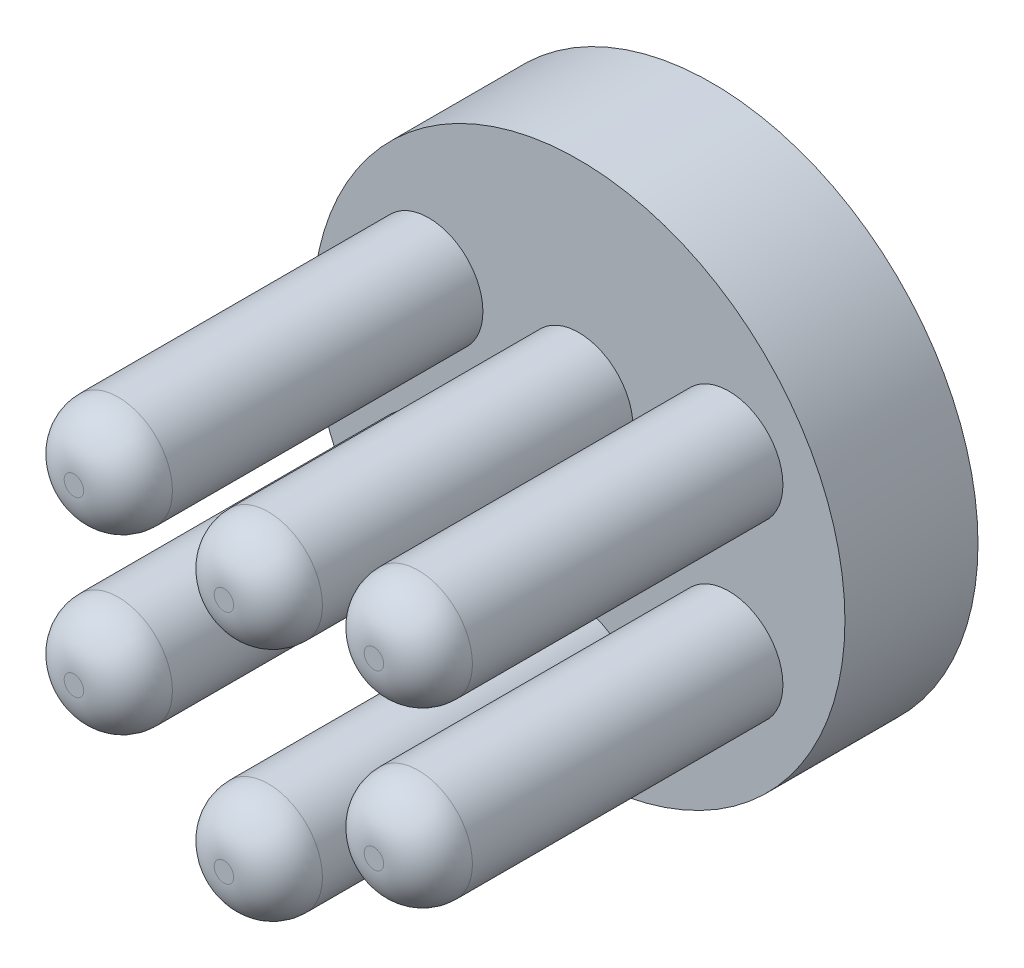
ISO-10303-21;
HEADER;
FILE_DESCRIPTION(('STEP AP214'),'2;1');
FILE_NAME('part.step','',(''),(''),'','','');
FILE_SCHEMA(('AUTOMOTIVE_DESIGN { 1 0 10303 214 1 1 1 1 }'));
ENDSEC;
DATA;
#1=APPLICATION_CONTEXT('core data for automotive mechanical design processes');
#2=APPLICATION_PROTOCOL_DEFINITION('international standard','automotive_design',2000,#1);
#3=PRODUCT_CONTEXT('',#1,'mechanical');
#4=PRODUCT('Part','Part','',(#3));
#5=PRODUCT_RELATED_PRODUCT_CATEGORY('part','',(#4));
#6=PRODUCT_DEFINITION_FORMATION('','',#4);
#7=PRODUCT_DEFINITION_CONTEXT('part definition',#1,'design');
#8=PRODUCT_DEFINITION('design','',#6,#7);
#9=PRODUCT_DEFINITION_SHAPE('','',#8);
#10=(LENGTH_UNIT() NAMED_UNIT(*) SI_UNIT(.MILLI.,.METRE.));
#11=(NAMED_UNIT(*) PLANE_ANGLE_UNIT() SI_UNIT($,.RADIAN.));
#12=(NAMED_UNIT(*) SI_UNIT($,.STERADIAN.) SOLID_ANGLE_UNIT());
#13=UNCERTAINTY_MEASURE_WITH_UNIT(LENGTH_MEASURE(1.E-05),#10,'distance_accuracy_value','');
#14=(GEOMETRIC_REPRESENTATION_CONTEXT(3) GLOBAL_UNCERTAINTY_ASSIGNED_CONTEXT((#13)) GLOBAL_UNIT_ASSIGNED_CONTEXT((#10,
#11,#12)) REPRESENTATION_CONTEXT('',''));
#15=CARTESIAN_POINT('',(0.,0.,0.));
#16=DIRECTION('',(0.,0.,1.));
#17=DIRECTION('',(1.,0.,0.));
#18=AXIS2_PLACEMENT_3D('',#15,#16,#17);
#19=CARTESIAN_POINT('',(-4.012170286,-2.7624278,10.16));
#20=DIRECTION('',(0.,0.,-1.));
#21=DIRECTION('',(-1.,0.,0.));
#22=AXIS2_PLACEMENT_3D('',#19,#20,#21);
#23=PLANE('',#22);
#24=CARTESIAN_POINT('',(-4.294923086,-2.479675,10.16));
#25=DIRECTION('',(0.,0.,1.));
#26=DIRECTION('',(1.,0.,0.));
#27=AXIS2_PLACEMENT_3D('',#24,#25,#26);
#28=CIRCLE('',#27,0.2794);
#29=CARTESIAN_POINT('',(-4.015523086,-2.479675,10.16));
#30=VERTEX_POINT('',#29);
#31=EDGE_CURVE('E18',#30,#30,#28,.F.);
#32=ORIENTED_EDGE('',*,*,#31,.F.);
#33=EDGE_LOOP('',(#32));
#34=FACE_BOUND('',#33,.T.);
#35=ADVANCED_FACE('F14',(#34),#23,.F.);
#36=CARTESIAN_POINT('',(0.2827528,1.5015972,10.16));
#37=DIRECTION('',(0.,0.,-1.));
#38=DIRECTION('',(-1.,0.,0.));
#39=AXIS2_PLACEMENT_3D('',#36,#37,#38);
#40=PLANE('',#39);
#41=CARTESIAN_POINT('',(0.,1.78435,10.16));
#42=DIRECTION('',(0.,0.,1.));
#43=DIRECTION('',(1.,0.,0.));
#44=AXIS2_PLACEMENT_3D('',#41,#42,#43);
#45=CIRCLE('',#44,0.2794);
#46=CARTESIAN_POINT('',(0.2794,1.78435,10.16));
#47=VERTEX_POINT('',#46);
#48=EDGE_CURVE('E77',#47,#47,#45,.F.);
#49=ORIENTED_EDGE('',*,*,#48,.F.);
#50=EDGE_LOOP('',(#49));
#51=FACE_BOUND('',#50,.T.);
#52=ADVANCED_FACE('F89',(#51),#40,.F.);
#53=CARTESIAN_POINT('',(4.577675886,-2.7624278,10.16));
#54=DIRECTION('',(0.,0.,-1.));
#55=DIRECTION('',(-1.,0.,0.));
#56=AXIS2_PLACEMENT_3D('',#53,#54,#55);
#57=PLANE('',#56);
#58=CARTESIAN_POINT('',(4.294923086,-2.479675,10.16));
#59=DIRECTION('',(0.,0.,1.));
#60=DIRECTION('',(1.,0.,0.));
#61=AXIS2_PLACEMENT_3D('',#58,#59,#60);
#62=CIRCLE('',#61,0.2794);
#63=CARTESIAN_POINT('',(4.574323086,-2.479675,10.16));
#64=VERTEX_POINT('',#63);
#65=EDGE_CURVE('E74',#64,#64,#62,.F.);
#66=ORIENTED_EDGE('',*,*,#65,.F.);
#67=EDGE_LOOP('',(#66));
#68=FACE_BOUND('',#67,.T.);
#69=ADVANCED_FACE('F95',(#68),#57,.F.);
#70=CARTESIAN_POINT('',(0.2827528,-5.2421028,10.16));
#71=DIRECTION('',(0.,0.,-1.));
#72=DIRECTION('',(-1.,0.,0.));
#73=AXIS2_PLACEMENT_3D('',#70,#71,#72);
#74=PLANE('',#73);
#75=CARTESIAN_POINT('',(0.,-4.95935,10.16));
#76=DIRECTION('',(0.,0.,1.));
#77=DIRECTION('',(1.,0.,0.));
#78=AXIS2_PLACEMENT_3D('',#75,#76,#77);
#79=CIRCLE('',#78,0.2794);
#80=CARTESIAN_POINT('',(0.2794,-4.95935,10.16));
#81=VERTEX_POINT('',#80);
#82=EDGE_CURVE('E70',#81,#81,#79,.F.);
#83=ORIENTED_EDGE('',*,*,#82,.F.);
#84=EDGE_LOOP('',(#83));
#85=FACE_BOUND('',#84,.T.);
#86=ADVANCED_FACE('F193',(#85),#74,.F.);
#87=CARTESIAN_POINT('',(4.577675886,2.1969222,10.16));
#88=DIRECTION('',(0.,0.,-1.));
#89=DIRECTION('',(-1.,0.,0.));
#90=AXIS2_PLACEMENT_3D('',#87,#88,#89);
#91=PLANE('',#90);
#92=CARTESIAN_POINT('',(4.294923086,2.479675,10.16));
#93=DIRECTION('',(0.,0.,1.));
#94=DIRECTION('',(1.,0.,0.));
#95=AXIS2_PLACEMENT_3D('',#92,#93,#94);
#96=CIRCLE('',#95,0.2794);
#97=CARTESIAN_POINT('',(4.574323086,2.479675,10.16));
#98=VERTEX_POINT('',#97);
#99=EDGE_CURVE('E66',#98,#98,#96,.F.);
#100=ORIENTED_EDGE('',*,*,#99,.F.);
#101=EDGE_LOOP('',(#100));
#102=FACE_BOUND('',#101,.T.);
#103=ADVANCED_FACE('F185',(#102),#91,.F.);
#104=CARTESIAN_POINT('',(-4.012170286,2.1969222,10.16));
#105=DIRECTION('',(0.,0.,-1.));
#106=DIRECTION('',(-1.,0.,0.));
#107=AXIS2_PLACEMENT_3D('',#104,#105,#106);
#108=PLANE('',#107);
#109=CARTESIAN_POINT('',(-4.294923086,2.479675,10.16));
#110=DIRECTION('',(0.,0.,1.));
#111=DIRECTION('',(1.,0.,0.));
#112=AXIS2_PLACEMENT_3D('',#109,#110,#111);
#113=CIRCLE('',#112,0.279399999999999);
#114=CARTESIAN_POINT('',(-4.015523086,2.479675,10.16));
#115=VERTEX_POINT('',#114);
#116=EDGE_CURVE('E62',#115,#115,#113,.F.);
#117=ORIENTED_EDGE('',*,*,#116,.F.);
#118=EDGE_LOOP('',(#117));
#119=FACE_BOUND('',#118,.T.);
#120=ADVANCED_FACE('F183',(#119),#108,.F.);
#121=CARTESIAN_POINT('',(-4.294923086,-2.479675,8.89));
#122=DIRECTION('',(0.,0.,1.));
#123=DIRECTION('',(1.,0.,0.));
#124=AXIS2_PLACEMENT_3D('',#121,#122,#123);
#125=DEGENERATE_TOROIDAL_SURFACE('',#124,0.2794,1.27,.T.);
#126=CARTESIAN_POINT('',(-4.294923086,-2.479675,8.89));
#127=DIRECTION('',(0.,0.,1.));
#128=DIRECTION('',(1.,0.,0.));
#129=AXIS2_PLACEMENT_3D('',#126,#127,#128);
#130=CIRCLE('',#129,1.5494);
#131=CARTESIAN_POINT('',(-2.745523086,-2.479675,8.89));
#132=VERTEX_POINT('',#131);
#133=EDGE_CURVE('E35',#132,#132,#130,.T.);
#134=ORIENTED_EDGE('',*,*,#133,.T.);
#135=EDGE_LOOP('',(#134));
#136=FACE_BOUND('',#135,.T.);
#137=ORIENTED_EDGE('',*,*,#31,.T.);
#138=EDGE_LOOP('',(#137));
#139=FACE_BOUND('',#138,.T.);
#140=ADVANCED_FACE('F86',(#136,#139),#125,.T.);
#141=CARTESIAN_POINT('',(0.,1.78435,8.89));
#142=DIRECTION('',(0.,0.,1.));
#143=DIRECTION('',(1.,0.,0.));
#144=AXIS2_PLACEMENT_3D('',#141,#142,#143);
#145=DEGENERATE_TOROIDAL_SURFACE('',#144,0.2794,1.27,.T.);
#146=ORIENTED_EDGE('',*,*,#48,.T.);
#147=EDGE_LOOP('',(#146));
#148=FACE_BOUND('',#147,.T.);
#149=CARTESIAN_POINT('',(0.,1.78435,8.89));
#150=DIRECTION('',(0.,0.,1.));
#151=DIRECTION('',(1.,0.,0.));
#152=AXIS2_PLACEMENT_3D('',#149,#150,#151);
#153=CIRCLE('',#152,1.5494);
#154=CARTESIAN_POINT('',(1.5494,1.78435,8.89));
#155=VERTEX_POINT('',#154);
#156=EDGE_CURVE('E147',#155,#155,#153,.T.);
#157=ORIENTED_EDGE('',*,*,#156,.T.);
#158=EDGE_LOOP('',(#157));
#159=FACE_BOUND('',#158,.T.);
#160=ADVANCED_FACE('F191',(#148,#159),#145,.T.);
#161=CARTESIAN_POINT('',(4.294923086,-2.479675,8.89));
#162=DIRECTION('',(0.,0.,1.));
#163=DIRECTION('',(1.,0.,0.));
#164=AXIS2_PLACEMENT_3D('',#161,#162,#163);
#165=DEGENERATE_TOROIDAL_SURFACE('',#164,0.279399999999998,1.27,.T.);
#166=ORIENTED_EDGE('',*,*,#65,.T.);
#167=EDGE_LOOP('',(#166));
#168=FACE_BOUND('',#167,.T.);
#169=CARTESIAN_POINT('',(4.294923086,-2.479675,8.89));
#170=DIRECTION('',(0.,0.,1.));
#171=DIRECTION('',(1.,0.,0.));
#172=AXIS2_PLACEMENT_3D('',#169,#170,#171);
#173=CIRCLE('',#172,1.5494);
#174=CARTESIAN_POINT('',(5.844323086,-2.479675,8.89));
#175=VERTEX_POINT('',#174);
#176=EDGE_CURVE('E150',#175,#175,#173,.T.);
#177=ORIENTED_EDGE('',*,*,#176,.T.);
#178=EDGE_LOOP('',(#177));
#179=FACE_BOUND('',#178,.T.);
#180=ADVANCED_FACE('F200',(#168,#179),#165,.T.);
#181=CARTESIAN_POINT('',(0.,-4.95935,8.89));
#182=DIRECTION('',(0.,0.,1.));
#183=DIRECTION('',(1.,0.,0.));
#184=AXIS2_PLACEMENT_3D('',#181,#182,#183);
#185=DEGENERATE_TOROIDAL_SURFACE('',#184,0.2794,1.27,.T.);
#186=ORIENTED_EDGE('',*,*,#82,.T.);
#187=EDGE_LOOP('',(#186));
#188=FACE_BOUND('',#187,.T.);
#189=CARTESIAN_POINT('',(0.,-4.95935,8.89));
#190=DIRECTION('',(0.,0.,1.));
#191=DIRECTION('',(1.,0.,0.));
#192=AXIS2_PLACEMENT_3D('',#189,#190,#191);
#193=CIRCLE('',#192,1.5494);
#194=CARTESIAN_POINT('',(1.5494,-4.95935,8.89));
#195=VERTEX_POINT('',#194);
#196=EDGE_CURVE('E155',#195,#195,#193,.T.);
#197=ORIENTED_EDGE('',*,*,#196,.T.);
#198=EDGE_LOOP('',(#197));
#199=FACE_BOUND('',#198,.T.);
#200=ADVANCED_FACE('F203',(#188,#199),#185,.T.);
#201=CARTESIAN_POINT('',(4.294923086,2.479675,8.89));
#202=DIRECTION('',(0.,0.,1.));
#203=DIRECTION('',(1.,0.,0.));
#204=AXIS2_PLACEMENT_3D('',#201,#202,#203);
#205=DEGENERATE_TOROIDAL_SURFACE('',#204,0.279399999999998,1.27,.T.);
#206=ORIENTED_EDGE('',*,*,#99,.T.);
#207=EDGE_LOOP('',(#206));
#208=FACE_BOUND('',#207,.T.);
#209=CARTESIAN_POINT('',(4.294923086,2.479675,8.89));
#210=DIRECTION('',(0.,0.,1.));
#211=DIRECTION('',(1.,0.,0.));
#212=AXIS2_PLACEMENT_3D('',#209,#210,#211);
#213=CIRCLE('',#212,1.5494);
#214=CARTESIAN_POINT('',(5.844323086,2.479675,8.89));
#215=VERTEX_POINT('',#214);
#216=EDGE_CURVE('E160',#215,#215,#213,.T.);
#217=ORIENTED_EDGE('',*,*,#216,.T.);
#218=EDGE_LOOP('',(#217));
#219=FACE_BOUND('',#218,.T.);
#220=ADVANCED_FACE('F137',(#208,#219),#205,.T.);
#221=CARTESIAN_POINT('',(-4.294923086,2.479675,8.89));
#222=DIRECTION('',(0.,0.,1.));
#223=DIRECTION('',(1.,0.,0.));
#224=AXIS2_PLACEMENT_3D('',#221,#222,#223);
#225=DEGENERATE_TOROIDAL_SURFACE('',#224,0.2794,1.27,.T.);
#226=CARTESIAN_POINT('',(-4.294923086,2.479675,8.89));
#227=DIRECTION('',(0.,0.,1.));
#228=DIRECTION('',(1.,0.,0.));
#229=AXIS2_PLACEMENT_3D('',#226,#227,#228);
#230=CIRCLE('',#229,1.5494);
#231=CARTESIAN_POINT('',(-2.745523086,2.479675,8.89));
#232=VERTEX_POINT('',#231);
#233=EDGE_CURVE('E61',#232,#232,#230,.T.);
#234=ORIENTED_EDGE('',*,*,#233,.T.);
#235=EDGE_LOOP('',(#234));
#236=FACE_BOUND('',#235,.T.);
#237=ORIENTED_EDGE('',*,*,#116,.T.);
#238=EDGE_LOOP('',(#237));
#239=FACE_BOUND('',#238,.T.);
#240=ADVANCED_FACE('F132',(#236,#239),#225,.T.);
#241=CARTESIAN_POINT('',(-4.294923086,-2.479675,0.));
#242=DIRECTION('',(0.,0.,1.));
#243=DIRECTION('',(1.,0.,0.));
#244=AXIS2_PLACEMENT_3D('',#241,#242,#243);
#245=CYLINDRICAL_SURFACE('',#244,1.5494);
#246=ORIENTED_EDGE('',*,*,#133,.F.);
#247=EDGE_LOOP('',(#246));
#248=FACE_BOUND('',#247,.T.);
#249=CARTESIAN_POINT('',(-4.294923086,-2.479675,0.));
#250=DIRECTION('',(0.,0.,1.));
#251=DIRECTION('',(1.,0.,0.));
#252=AXIS2_PLACEMENT_3D('',#249,#250,#251);
#253=CIRCLE('',#252,1.5494);
#254=CARTESIAN_POINT('',(-2.745523086,-2.479675,0.));
#255=VERTEX_POINT('',#254);
#256=EDGE_CURVE('E57',#255,#255,#253,.T.);
#257=ORIENTED_EDGE('',*,*,#256,.T.);
#258=EDGE_LOOP('',(#257));
#259=FACE_BOUND('',#258,.T.);
#260=ADVANCED_FACE('F129',(#248,#259),#245,.T.);
#261=CARTESIAN_POINT('',(0.,1.78435,0.));
#262=DIRECTION('',(0.,0.,1.));
#263=DIRECTION('',(1.,0.,0.));
#264=AXIS2_PLACEMENT_3D('',#261,#262,#263);
#265=CYLINDRICAL_SURFACE('',#264,1.5494);
#266=ORIENTED_EDGE('',*,*,#156,.F.);
#267=EDGE_LOOP('',(#266));
#268=FACE_BOUND('',#267,.T.);
#269=CARTESIAN_POINT('',(0.,1.78435,0.));
#270=DIRECTION('',(0.,0.,1.));
#271=DIRECTION('',(1.,0.,0.));
#272=AXIS2_PLACEMENT_3D('',#269,#270,#271);
#273=CIRCLE('',#272,1.5494);
#274=CARTESIAN_POINT('',(1.5494,1.78435,0.));
#275=VERTEX_POINT('',#274);
#276=EDGE_CURVE('E53',#275,#275,#273,.T.);
#277=ORIENTED_EDGE('',*,*,#276,.T.);
#278=EDGE_LOOP('',(#277));
#279=FACE_BOUND('',#278,.T.);
#280=ADVANCED_FACE('F126',(#268,#279),#265,.T.);
#281=CARTESIAN_POINT('',(4.294923086,-2.479675,0.));
#282=DIRECTION('',(0.,0.,1.));
#283=DIRECTION('',(1.,0.,0.));
#284=AXIS2_PLACEMENT_3D('',#281,#282,#283);
#285=CYLINDRICAL_SURFACE('',#284,1.5494);
#286=ORIENTED_EDGE('',*,*,#176,.F.);
#287=EDGE_LOOP('',(#286));
#288=FACE_BOUND('',#287,.T.);
#289=CARTESIAN_POINT('',(4.294923086,-2.479675,0.));
#290=DIRECTION('',(0.,0.,1.));
#291=DIRECTION('',(1.,0.,0.));
#292=AXIS2_PLACEMENT_3D('',#289,#290,#291);
#293=CIRCLE('',#292,1.5494);
#294=CARTESIAN_POINT('',(5.844323086,-2.479675,0.));
#295=VERTEX_POINT('',#294);
#296=EDGE_CURVE('E49',#295,#295,#293,.T.);
#297=ORIENTED_EDGE('',*,*,#296,.T.);
#298=EDGE_LOOP('',(#297));
#299=FACE_BOUND('',#298,.T.);
#300=ADVANCED_FACE('F122',(#288,#299),#285,.T.);
#301=CARTESIAN_POINT('',(0.,-4.95935,0.));
#302=DIRECTION('',(0.,0.,1.));
#303=DIRECTION('',(1.,0.,0.));
#304=AXIS2_PLACEMENT_3D('',#301,#302,#303);
#305=CYLINDRICAL_SURFACE('',#304,1.5494);
#306=ORIENTED_EDGE('',*,*,#196,.F.);
#307=EDGE_LOOP('',(#306));
#308=FACE_BOUND('',#307,.T.);
#309=CARTESIAN_POINT('',(0.,-4.95935,0.));
#310=DIRECTION('',(0.,0.,1.));
#311=DIRECTION('',(1.,0.,0.));
#312=AXIS2_PLACEMENT_3D('',#309,#310,#311);
#313=CIRCLE('',#312,1.5494);
#314=CARTESIAN_POINT('',(1.5494,-4.95935,0.));
#315=VERTEX_POINT('',#314);
#316=EDGE_CURVE('E45',#315,#315,#313,.T.);
#317=ORIENTED_EDGE('',*,*,#316,.T.);
#318=EDGE_LOOP('',(#317));
#319=FACE_BOUND('',#318,.T.);
#320=ADVANCED_FACE('F118',(#308,#319),#305,.T.);
#321=CARTESIAN_POINT('',(4.294923086,2.479675,0.));
#322=DIRECTION('',(0.,0.,1.));
#323=DIRECTION('',(1.,0.,0.));
#324=AXIS2_PLACEMENT_3D('',#321,#322,#323);
#325=CYLINDRICAL_SURFACE('',#324,1.5494);
#326=ORIENTED_EDGE('',*,*,#216,.F.);
#327=EDGE_LOOP('',(#326));
#328=FACE_BOUND('',#327,.T.);
#329=CARTESIAN_POINT('',(4.294923086,2.479675,0.));
#330=DIRECTION('',(0.,0.,1.));
#331=DIRECTION('',(1.,0.,0.));
#332=AXIS2_PLACEMENT_3D('',#329,#330,#331);
#333=CIRCLE('',#332,1.5494);
#334=CARTESIAN_POINT('',(5.844323086,2.479675,0.));
#335=VERTEX_POINT('',#334);
#336=EDGE_CURVE('E41',#335,#335,#333,.T.);
#337=ORIENTED_EDGE('',*,*,#336,.T.);
#338=EDGE_LOOP('',(#337));
#339=FACE_BOUND('',#338,.T.);
#340=ADVANCED_FACE('F114',(#328,#339),#325,.T.);
#341=CARTESIAN_POINT('',(-4.294923086,2.479675,0.));
#342=DIRECTION('',(0.,0.,1.));
#343=DIRECTION('',(1.,0.,0.));
#344=AXIS2_PLACEMENT_3D('',#341,#342,#343);
#345=CYLINDRICAL_SURFACE('',#344,1.5494);
#346=ORIENTED_EDGE('',*,*,#233,.F.);
#347=EDGE_LOOP('',(#346));
#348=FACE_BOUND('',#347,.T.);
#349=CARTESIAN_POINT('',(-4.294923086,2.479675,0.));
#350=DIRECTION('',(0.,0.,1.));
#351=DIRECTION('',(1.,0.,0.));
#352=AXIS2_PLACEMENT_3D('',#349,#350,#351);
#353=CIRCLE('',#352,1.5494);
#354=CARTESIAN_POINT('',(-2.745523086,2.479675,0.));
#355=VERTEX_POINT('',#354);
#356=EDGE_CURVE('E32',#355,#355,#353,.T.);
#357=ORIENTED_EDGE('',*,*,#356,.T.);
#358=EDGE_LOOP('',(#357));
#359=FACE_BOUND('',#358,.T.);
#360=ADVANCED_FACE('F111',(#348,#359),#345,.T.);
#361=CARTESIAN_POINT('',(7.71144,-7.71144,-3.81));
#362=DIRECTION('',(0.,0.,-1.));
#363=DIRECTION('',(-1.,0.,0.));
#364=AXIS2_PLACEMENT_3D('',#361,#362,#363);
#365=PLANE('',#364);
#366=CARTESIAN_POINT('',(0.,0.,-3.81));
#367=DIRECTION('',(0.,0.,-1.));
#368=DIRECTION('',(-1.,0.,0.));
#369=AXIS2_PLACEMENT_3D('',#366,#367,#368);
#370=CIRCLE('',#369,7.62);
#371=CARTESIAN_POINT('',(-7.62,0.,-3.81));
#372=VERTEX_POINT('',#371);
#373=EDGE_CURVE('E23',#372,#372,#370,.T.);
#374=ORIENTED_EDGE('',*,*,#373,.T.);
#375=EDGE_LOOP('',(#374));
#376=FACE_BOUND('',#375,.T.);
#377=ADVANCED_FACE('F106',(#376),#365,.T.);
#378=CARTESIAN_POINT('',(7.71144,-7.71144,0.));
#379=DIRECTION('',(0.,0.,-1.));
#380=DIRECTION('',(-1.,0.,0.));
#381=AXIS2_PLACEMENT_3D('',#378,#379,#380);
#382=PLANE('',#381);
#383=ORIENTED_EDGE('',*,*,#356,.F.);
#384=EDGE_LOOP('',(#383));
#385=FACE_BOUND('',#384,.T.);
#386=ORIENTED_EDGE('',*,*,#336,.F.);
#387=EDGE_LOOP('',(#386));
#388=FACE_BOUND('',#387,.T.);
#389=ORIENTED_EDGE('',*,*,#316,.F.);
#390=EDGE_LOOP('',(#389));
#391=FACE_BOUND('',#390,.T.);
#392=ORIENTED_EDGE('',*,*,#296,.F.);
#393=EDGE_LOOP('',(#392));
#394=FACE_BOUND('',#393,.T.);
#395=ORIENTED_EDGE('',*,*,#276,.F.);
#396=EDGE_LOOP('',(#395));
#397=FACE_BOUND('',#396,.T.);
#398=ORIENTED_EDGE('',*,*,#256,.F.);
#399=EDGE_LOOP('',(#398));
#400=FACE_BOUND('',#399,.T.);
#401=CARTESIAN_POINT('',(0.,0.,0.));
#402=DIRECTION('',(0.,0.,-1.));
#403=DIRECTION('',(-1.,0.,0.));
#404=AXIS2_PLACEMENT_3D('',#401,#402,#403);
#405=CIRCLE('',#404,7.62);
#406=CARTESIAN_POINT('',(-7.62,0.,0.));
#407=VERTEX_POINT('',#406);
#408=EDGE_CURVE('E10',#407,#407,#405,.F.);
#409=ORIENTED_EDGE('',*,*,#408,.T.);
#410=EDGE_LOOP('',(#409));
#411=FACE_BOUND('',#410,.T.);
#412=ADVANCED_FACE('F16',(#385,#388,#391,#394,#397,#400,#411),#382,.F.);
#413=CARTESIAN_POINT('',(0.,0.,0.));
#414=DIRECTION('',(0.,0.,-1.));
#415=DIRECTION('',(-1.,0.,0.));
#416=AXIS2_PLACEMENT_3D('',#413,#414,#415);
#417=CYLINDRICAL_SURFACE('',#416,7.62);
#418=ORIENTED_EDGE('',*,*,#373,.F.);
#419=EDGE_LOOP('',(#418));
#420=FACE_BOUND('',#419,.T.);
#421=ORIENTED_EDGE('',*,*,#408,.F.);
#422=EDGE_LOOP('',(#421));
#423=FACE_BOUND('',#422,.T.);
#424=ADVANCED_FACE('F99',(#420,#423),#417,.T.);
#425=CLOSED_SHELL('',(#35,#52,#69,#86,#103,#120,#140,#160,#180,#200,#220,#240,#260,#280,#300,
#320,#340,#360,#377,#412,#424));
#426=MANIFOLD_SOLID_BREP('B1',#425);
#427=ADVANCED_BREP_SHAPE_REPRESENTATION('',(#18,#426),#14);
#428=SHAPE_DEFINITION_REPRESENTATION(#9,#427);
ENDSEC;
END-ISO-10303-21;
